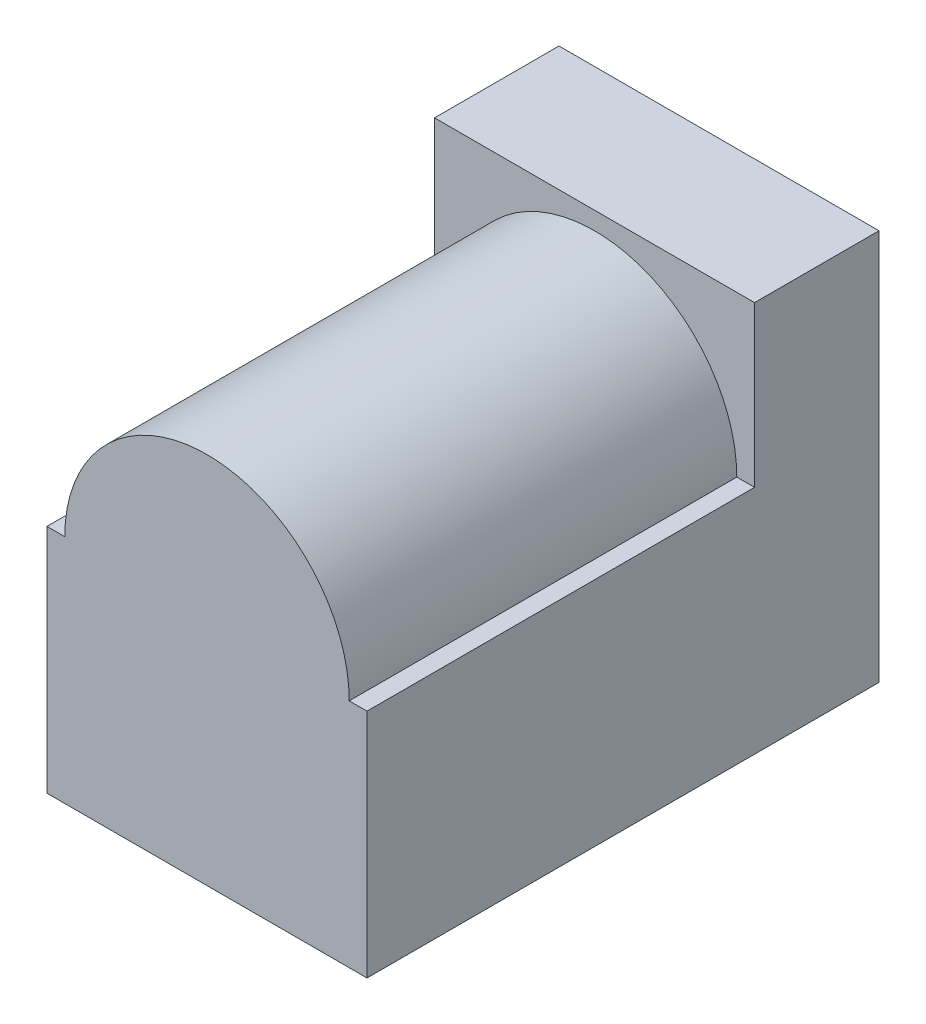
ISO-10303-21;
HEADER;
FILE_DESCRIPTION(('STEP AP214'),'2;1');
FILE_NAME('part.step','',(''),(''),'','','');
FILE_SCHEMA(('AUTOMOTIVE_DESIGN { 1 0 10303 214 1 1 1 1 }'));
ENDSEC;
DATA;
#1=APPLICATION_CONTEXT('core data for automotive mechanical design processes');
#2=APPLICATION_PROTOCOL_DEFINITION('international standard','automotive_design',2000,#1);
#3=PRODUCT_CONTEXT('',#1,'mechanical');
#4=PRODUCT('Part','Part','',(#3));
#5=PRODUCT_RELATED_PRODUCT_CATEGORY('part','',(#4));
#6=PRODUCT_DEFINITION_FORMATION('','',#4);
#7=PRODUCT_DEFINITION_CONTEXT('part definition',#1,'design');
#8=PRODUCT_DEFINITION('design','',#6,#7);
#9=PRODUCT_DEFINITION_SHAPE('','',#8);
#10=(LENGTH_UNIT() NAMED_UNIT(*) SI_UNIT(.MILLI.,.METRE.));
#11=(NAMED_UNIT(*) PLANE_ANGLE_UNIT() SI_UNIT($,.RADIAN.));
#12=(NAMED_UNIT(*) SI_UNIT($,.STERADIAN.) SOLID_ANGLE_UNIT());
#13=UNCERTAINTY_MEASURE_WITH_UNIT(LENGTH_MEASURE(1.E-05),#10,'distance_accuracy_value','');
#14=(GEOMETRIC_REPRESENTATION_CONTEXT(3) GLOBAL_UNCERTAINTY_ASSIGNED_CONTEXT((#13)) GLOBAL_UNIT_ASSIGNED_CONTEXT((#10,
#11,#12)) REPRESENTATION_CONTEXT('',''));
#15=CARTESIAN_POINT('',(0.,0.,0.));
#16=DIRECTION('',(0.,0.,1.));
#17=DIRECTION('',(1.,0.,0.));
#18=AXIS2_PLACEMENT_3D('',#15,#16,#17);
#19=CARTESIAN_POINT('',(0.,0.,3.5));
#20=DIRECTION('',(1.,0.,0.));
#21=DIRECTION('',(0.,0.,-1.));
#22=AXIS2_PLACEMENT_3D('',#19,#20,#21);
#23=PLANE('',#22);
#24=DIRECTION('',(0.,-1.,0.));
#25=VECTOR('',#24,1.);
#26=CARTESIAN_POINT('',(0.,0.,0.));
#27=LINE('',#26,#25);
#28=CARTESIAN_POINT('',(0.,11.,0.));
#29=VERTEX_POINT('',#28);
#30=CARTESIAN_POINT('',(0.,0.,0.));
#31=VERTEX_POINT('',#30);
#32=EDGE_CURVE('E96',#29,#31,#27,.T.);
#33=ORIENTED_EDGE('',*,*,#32,.T.);
#34=DIRECTION('',(0.,0.,-1.));
#35=VECTOR('',#34,1.);
#36=CARTESIAN_POINT('',(0.,0.,3.5));
#37=LINE('',#36,#35);
#38=CARTESIAN_POINT('',(0.,0.,14.4));
#39=VERTEX_POINT('',#38);
#40=EDGE_CURVE('E11',#39,#31,#37,.T.);
#41=ORIENTED_EDGE('',*,*,#40,.F.);
#42=DIRECTION('',(0.,1.,0.));
#43=VECTOR('',#42,1.);
#44=CARTESIAN_POINT('',(0.,6.5,14.4));
#45=LINE('',#44,#43);
#46=CARTESIAN_POINT('',(0.,6.5,14.4));
#47=VERTEX_POINT('',#46);
#48=EDGE_CURVE('E139',#39,#47,#45,.T.);
#49=ORIENTED_EDGE('',*,*,#48,.T.);
#50=DIRECTION('',(0.,0.,-1.));
#51=VECTOR('',#50,1.);
#52=CARTESIAN_POINT('',(0.,6.5,14.4));
#53=LINE('',#52,#51);
#54=CARTESIAN_POINT('',(0.,6.5,3.5));
#55=VERTEX_POINT('',#54);
#56=EDGE_CURVE('E154',#47,#55,#53,.T.);
#57=ORIENTED_EDGE('',*,*,#56,.T.);
#58=DIRECTION('',(0.,-1.,0.));
#59=VECTOR('',#58,1.);
#60=CARTESIAN_POINT('',(0.,0.,3.5));
#61=LINE('',#60,#59);
#62=CARTESIAN_POINT('',(0.,11.,3.5));
#63=VERTEX_POINT('',#62);
#64=EDGE_CURVE('E91',#63,#55,#61,.T.);
#65=ORIENTED_EDGE('',*,*,#64,.F.);
#66=DIRECTION('',(0.,0.,-1.));
#67=VECTOR('',#66,1.);
#68=CARTESIAN_POINT('',(0.,11.,3.5));
#69=LINE('',#68,#67);
#70=EDGE_CURVE('E84',#63,#29,#69,.T.);
#71=ORIENTED_EDGE('',*,*,#70,.T.);
#72=EDGE_LOOP('',(#33,#41,#49,#57,#65,#71));
#73=FACE_BOUND('',#72,.T.);
#74=ADVANCED_FACE('F39',(#73),#23,.F.);
#75=CARTESIAN_POINT('',(0.,0.,3.5));
#76=DIRECTION('',(0.,1.,0.));
#77=DIRECTION('',(0.,0.,1.));
#78=AXIS2_PLACEMENT_3D('',#75,#76,#77);
#79=PLANE('',#78);
#80=DIRECTION('',(1.,0.,0.));
#81=VECTOR('',#80,1.);
#82=CARTESIAN_POINT('',(0.,0.,0.));
#83=LINE('',#82,#81);
#84=CARTESIAN_POINT('',(9.,0.,0.));
#85=VERTEX_POINT('',#84);
#86=EDGE_CURVE('E101',#31,#85,#83,.T.);
#87=ORIENTED_EDGE('',*,*,#86,.T.);
#88=DIRECTION('',(0.,0.,-1.));
#89=VECTOR('',#88,1.);
#90=CARTESIAN_POINT('',(9.,0.,3.5));
#91=LINE('',#90,#89);
#92=CARTESIAN_POINT('',(9.,0.,14.4));
#93=VERTEX_POINT('',#92);
#94=EDGE_CURVE('E46',#93,#85,#91,.T.);
#95=ORIENTED_EDGE('',*,*,#94,.F.);
#96=DIRECTION('',(-1.,0.,0.));
#97=VECTOR('',#96,1.);
#98=CARTESIAN_POINT('',(0.,0.,14.4));
#99=LINE('',#98,#97);
#100=EDGE_CURVE('E129',#93,#39,#99,.T.);
#101=ORIENTED_EDGE('',*,*,#100,.T.);
#102=ORIENTED_EDGE('',*,*,#40,.T.);
#103=EDGE_LOOP('',(#87,#95,#101,#102));
#104=FACE_BOUND('',#103,.T.);
#105=ADVANCED_FACE('F127',(#104),#79,.F.);
#106=CARTESIAN_POINT('',(9.,0.,3.5));
#107=DIRECTION('',(-1.,0.,0.));
#108=DIRECTION('',(0.,-1.,0.));
#109=AXIS2_PLACEMENT_3D('',#106,#107,#108);
#110=PLANE('',#109);
#111=DIRECTION('',(0.,1.,0.));
#112=VECTOR('',#111,1.);
#113=CARTESIAN_POINT('',(9.,0.,3.5));
#114=LINE('',#113,#112);
#115=CARTESIAN_POINT('',(9.,6.5,3.5));
#116=VERTEX_POINT('',#115);
#117=CARTESIAN_POINT('',(9.,11.,3.5));
#118=VERTEX_POINT('',#117);
#119=EDGE_CURVE('E162',#116,#118,#114,.T.);
#120=ORIENTED_EDGE('',*,*,#119,.F.);
#121=DIRECTION('',(0.,0.,-1.));
#122=VECTOR('',#121,1.);
#123=CARTESIAN_POINT('',(9.,6.5,14.4));
#124=LINE('',#123,#122);
#125=CARTESIAN_POINT('',(9.,6.5,14.4));
#126=VERTEX_POINT('',#125);
#127=EDGE_CURVE('E53',#126,#116,#124,.T.);
#128=ORIENTED_EDGE('',*,*,#127,.F.);
#129=DIRECTION('',(0.,-1.,0.));
#130=VECTOR('',#129,1.);
#131=CARTESIAN_POINT('',(9.,0.,14.4));
#132=LINE('',#131,#130);
#133=EDGE_CURVE('E123',#126,#93,#132,.T.);
#134=ORIENTED_EDGE('',*,*,#133,.T.);
#135=ORIENTED_EDGE('',*,*,#94,.T.);
#136=DIRECTION('',(0.,1.,0.));
#137=VECTOR('',#136,1.);
#138=CARTESIAN_POINT('',(9.,0.,0.));
#139=LINE('',#138,#137);
#140=CARTESIAN_POINT('',(9.,11.,0.));
#141=VERTEX_POINT('',#140);
#142=EDGE_CURVE('E92',#85,#141,#139,.T.);
#143=ORIENTED_EDGE('',*,*,#142,.T.);
#144=DIRECTION('',(0.,0.,-1.));
#145=VECTOR('',#144,1.);
#146=CARTESIAN_POINT('',(9.,11.,3.5));
#147=LINE('',#146,#145);
#148=EDGE_CURVE('E87',#118,#141,#147,.T.);
#149=ORIENTED_EDGE('',*,*,#148,.F.);
#150=EDGE_LOOP('',(#120,#128,#134,#135,#143,#149));
#151=FACE_BOUND('',#150,.T.);
#152=ADVANCED_FACE('F120',(#151),#110,.F.);
#153=CARTESIAN_POINT('',(0.,11.,3.5));
#154=DIRECTION('',(0.,-1.,0.));
#155=DIRECTION('',(0.,0.,-1.));
#156=AXIS2_PLACEMENT_3D('',#153,#154,#155);
#157=PLANE('',#156);
#158=DIRECTION('',(-1.,0.,0.));
#159=VECTOR('',#158,1.);
#160=CARTESIAN_POINT('',(0.,11.,0.));
#161=LINE('',#160,#159);
#162=EDGE_CURVE('E81',#141,#29,#161,.T.);
#163=ORIENTED_EDGE('',*,*,#162,.T.);
#164=ORIENTED_EDGE('',*,*,#70,.F.);
#165=DIRECTION('',(-1.,0.,0.));
#166=VECTOR('',#165,1.);
#167=CARTESIAN_POINT('',(0.,11.,3.5));
#168=LINE('',#167,#166);
#169=EDGE_CURVE('E62',#118,#63,#168,.T.);
#170=ORIENTED_EDGE('',*,*,#169,.F.);
#171=ORIENTED_EDGE('',*,*,#148,.T.);
#172=EDGE_LOOP('',(#163,#164,#170,#171));
#173=FACE_BOUND('',#172,.T.);
#174=ADVANCED_FACE('F83',(#173),#157,.F.);
#175=CARTESIAN_POINT('',(0.,0.,3.5));
#176=DIRECTION('',(0.,0.,-1.));
#177=DIRECTION('',(-1.,0.,0.));
#178=AXIS2_PLACEMENT_3D('',#175,#176,#177);
#179=PLANE('',#178);
#180=ORIENTED_EDGE('',*,*,#64,.T.);
#181=DIRECTION('',(1.,0.,0.));
#182=VECTOR('',#181,1.);
#183=CARTESIAN_POINT('',(0.,6.5,3.5));
#184=LINE('',#183,#182);
#185=CARTESIAN_POINT('',(0.5,6.5,3.5));
#186=VERTEX_POINT('',#185);
#187=EDGE_CURVE('E109',#55,#186,#184,.T.);
#188=ORIENTED_EDGE('',*,*,#187,.T.);
#189=CARTESIAN_POINT('',(4.5,6.5,3.5));
#190=DIRECTION('',(0.,0.,-1.));
#191=DIRECTION('',(-1.,0.,0.));
#192=AXIS2_PLACEMENT_3D('',#189,#190,#191);
#193=CIRCLE('',#192,4.);
#194=CARTESIAN_POINT('',(8.5,6.5,3.5));
#195=VERTEX_POINT('',#194);
#196=EDGE_CURVE('E103',#186,#195,#193,.T.);
#197=ORIENTED_EDGE('',*,*,#196,.T.);
#198=DIRECTION('',(1.,0.,0.));
#199=VECTOR('',#198,1.);
#200=CARTESIAN_POINT('',(0.,6.5,3.5));
#201=LINE('',#200,#199);
#202=EDGE_CURVE('E153',#195,#116,#201,.T.);
#203=ORIENTED_EDGE('',*,*,#202,.T.);
#204=ORIENTED_EDGE('',*,*,#119,.T.);
#205=ORIENTED_EDGE('',*,*,#169,.T.);
#206=EDGE_LOOP('',(#180,#188,#197,#203,#204,#205));
#207=FACE_BOUND('',#206,.T.);
#208=ADVANCED_FACE('F163',(#207),#179,.F.);
#209=CARTESIAN_POINT('',(0.,0.,0.));
#210=DIRECTION('',(0.,0.,-1.));
#211=DIRECTION('',(-1.,0.,0.));
#212=AXIS2_PLACEMENT_3D('',#209,#210,#211);
#213=PLANE('',#212);
#214=CARTESIAN_POINT('',(4.5,6.5,0.));
#215=DIRECTION('',(0.,0.,-1.));
#216=DIRECTION('',(-1.,0.,0.));
#217=AXIS2_PLACEMENT_3D('',#214,#215,#216);
#218=CIRCLE('',#217,3.25);
#219=CARTESIAN_POINT('',(1.25,6.5,0.));
#220=VERTEX_POINT('',#219);
#221=EDGE_CURVE('E190',#220,#220,#218,.T.);
#222=ORIENTED_EDGE('',*,*,#221,.F.);
#223=EDGE_LOOP('',(#222));
#224=FACE_BOUND('',#223,.T.);
#225=ORIENTED_EDGE('',*,*,#86,.F.);
#226=ORIENTED_EDGE('',*,*,#32,.F.);
#227=ORIENTED_EDGE('',*,*,#162,.F.);
#228=ORIENTED_EDGE('',*,*,#142,.F.);
#229=EDGE_LOOP('',(#225,#226,#227,#228));
#230=FACE_BOUND('',#229,.T.);
#231=ADVANCED_FACE('F100',(#224,#230),#213,.T.);
#232=CARTESIAN_POINT('',(4.5,6.5,14.4));
#233=DIRECTION('',(0.,0.,-1.));
#234=DIRECTION('',(-1.,0.,0.));
#235=AXIS2_PLACEMENT_3D('',#232,#233,#234);
#236=CYLINDRICAL_SURFACE('',#235,4.);
#237=ORIENTED_EDGE('',*,*,#196,.F.);
#238=DIRECTION('',(0.,0.,-1.));
#239=VECTOR('',#238,1.);
#240=CARTESIAN_POINT('',(0.5,6.5,14.4));
#241=LINE('',#240,#239);
#242=CARTESIAN_POINT('',(0.5,6.5,14.4));
#243=VERTEX_POINT('',#242);
#244=EDGE_CURVE('E150',#243,#186,#241,.T.);
#245=ORIENTED_EDGE('',*,*,#244,.F.);
#246=CARTESIAN_POINT('',(4.5,6.5,14.4));
#247=DIRECTION('',(0.,0.,-1.));
#248=DIRECTION('',(-1.,0.,0.));
#249=AXIS2_PLACEMENT_3D('',#246,#247,#248);
#250=CIRCLE('',#249,4.);
#251=CARTESIAN_POINT('',(8.5,6.5,14.4));
#252=VERTEX_POINT('',#251);
#253=EDGE_CURVE('E186',#243,#252,#250,.T.);
#254=ORIENTED_EDGE('',*,*,#253,.T.);
#255=DIRECTION('',(0.,0.,-1.));
#256=VECTOR('',#255,1.);
#257=CARTESIAN_POINT('',(8.5,6.5,14.4));
#258=LINE('',#257,#256);
#259=EDGE_CURVE('E149',#252,#195,#258,.T.);
#260=ORIENTED_EDGE('',*,*,#259,.T.);
#261=EDGE_LOOP('',(#237,#245,#254,#260));
#262=FACE_BOUND('',#261,.T.);
#263=ADVANCED_FACE('F182',(#262),#236,.T.);
#264=CARTESIAN_POINT('',(0.5,6.5,14.4));
#265=DIRECTION('',(0.,1.,0.));
#266=DIRECTION('',(0.,0.,1.));
#267=AXIS2_PLACEMENT_3D('',#264,#265,#266);
#268=PLANE('',#267);
#269=ORIENTED_EDGE('',*,*,#187,.F.);
#270=ORIENTED_EDGE('',*,*,#56,.F.);
#271=DIRECTION('',(1.,0.,0.));
#272=VECTOR('',#271,1.);
#273=CARTESIAN_POINT('',(0.5,6.5,14.4));
#274=LINE('',#273,#272);
#275=EDGE_CURVE('E141',#47,#243,#274,.T.);
#276=ORIENTED_EDGE('',*,*,#275,.T.);
#277=ORIENTED_EDGE('',*,*,#244,.T.);
#278=EDGE_LOOP('',(#269,#270,#276,#277));
#279=FACE_BOUND('',#278,.T.);
#280=ADVANCED_FACE('F185',(#279),#268,.T.);
#281=CARTESIAN_POINT('',(9.,6.5,14.4));
#282=DIRECTION('',(0.,1.,0.));
#283=DIRECTION('',(0.,0.,1.));
#284=AXIS2_PLACEMENT_3D('',#281,#282,#283);
#285=PLANE('',#284);
#286=ORIENTED_EDGE('',*,*,#202,.F.);
#287=ORIENTED_EDGE('',*,*,#259,.F.);
#288=DIRECTION('',(1.,0.,0.));
#289=VECTOR('',#288,1.);
#290=CARTESIAN_POINT('',(9.,6.5,14.4));
#291=LINE('',#290,#289);
#292=EDGE_CURVE('E143',#252,#126,#291,.T.);
#293=ORIENTED_EDGE('',*,*,#292,.T.);
#294=ORIENTED_EDGE('',*,*,#127,.T.);
#295=EDGE_LOOP('',(#286,#287,#293,#294));
#296=FACE_BOUND('',#295,.T.);
#297=ADVANCED_FACE('F266',(#296),#285,.T.);
#298=CARTESIAN_POINT('',(4.5,6.5,14.4));
#299=DIRECTION('',(0.,0.,-1.));
#300=DIRECTION('',(-1.,0.,0.));
#301=AXIS2_PLACEMENT_3D('',#298,#299,#300);
#302=PLANE('',#301);
#303=ORIENTED_EDGE('',*,*,#253,.F.);
#304=ORIENTED_EDGE('',*,*,#275,.F.);
#305=ORIENTED_EDGE('',*,*,#48,.F.);
#306=ORIENTED_EDGE('',*,*,#100,.F.);
#307=ORIENTED_EDGE('',*,*,#133,.F.);
#308=ORIENTED_EDGE('',*,*,#292,.F.);
#309=EDGE_LOOP('',(#303,#304,#305,#306,#307,#308));
#310=FACE_BOUND('',#309,.T.);
#311=ADVANCED_FACE('F135',(#310),#302,.F.);
#312=CARTESIAN_POINT('',(4.5,6.5,10.));
#313=DIRECTION('',(0.,0.,-1.));
#314=DIRECTION('',(-1.,0.,0.));
#315=AXIS2_PLACEMENT_3D('',#312,#313,#314);
#316=CYLINDRICAL_SURFACE('',#315,3.25);
#317=CARTESIAN_POINT('',(4.5,6.5,10.));
#318=DIRECTION('',(0.,0.,-1.));
#319=DIRECTION('',(-1.,0.,0.));
#320=AXIS2_PLACEMENT_3D('',#317,#318,#319);
#321=CIRCLE('',#320,3.25);
#322=CARTESIAN_POINT('',(1.25,6.5,10.));
#323=VERTEX_POINT('',#322);
#324=EDGE_CURVE('E187',#323,#323,#321,.T.);
#325=ORIENTED_EDGE('',*,*,#324,.F.);
#326=EDGE_LOOP('',(#325));
#327=FACE_BOUND('',#326,.T.);
#328=ORIENTED_EDGE('',*,*,#221,.T.);
#329=EDGE_LOOP('',(#328));
#330=FACE_BOUND('',#329,.T.);
#331=ADVANCED_FACE('F208',(#327,#330),#316,.F.);
#332=CARTESIAN_POINT('',(4.5,6.5,10.));
#333=DIRECTION('',(0.,0.,-1.));
#334=DIRECTION('',(-1.,0.,0.));
#335=AXIS2_PLACEMENT_3D('',#332,#333,#334);
#336=PLANE('',#335);
#337=CARTESIAN_POINT('',(4.5,6.5,10.));
#338=DIRECTION('',(0.,0.,-1.));
#339=DIRECTION('',(-1.,0.,0.));
#340=AXIS2_PLACEMENT_3D('',#337,#338,#339);
#341=CIRCLE('',#340,1.);
#342=CARTESIAN_POINT('',(3.5,6.5,10.));
#343=VERTEX_POINT('',#342);
#344=EDGE_CURVE('E194',#343,#343,#341,.T.);
#345=ORIENTED_EDGE('',*,*,#344,.F.);
#346=EDGE_LOOP('',(#345));
#347=FACE_BOUND('',#346,.T.);
#348=ORIENTED_EDGE('',*,*,#324,.T.);
#349=EDGE_LOOP('',(#348));
#350=FACE_BOUND('',#349,.T.);
#351=ADVANCED_FACE('F205',(#347,#350),#336,.T.);
#352=CARTESIAN_POINT('',(4.5,6.5,10.));
#353=DIRECTION('',(0.,0.,-1.));
#354=DIRECTION('',(-1.,0.,0.));
#355=AXIS2_PLACEMENT_3D('',#352,#353,#354);
#356=CYLINDRICAL_SURFACE('',#355,1.);
#357=ORIENTED_EDGE('',*,*,#344,.T.);
#358=EDGE_LOOP('',(#357));
#359=FACE_BOUND('',#358,.T.);
#360=CARTESIAN_POINT('',(4.5,6.5,0.));
#361=DIRECTION('',(0.,0.,-1.));
#362=DIRECTION('',(-1.,0.,0.));
#363=AXIS2_PLACEMENT_3D('',#360,#361,#362);
#364=CIRCLE('',#363,1.);
#365=CARTESIAN_POINT('',(3.5,6.5,0.));
#366=VERTEX_POINT('',#365);
#367=EDGE_CURVE('E196',#366,#366,#364,.T.);
#368=ORIENTED_EDGE('',*,*,#367,.F.);
#369=EDGE_LOOP('',(#368));
#370=FACE_BOUND('',#369,.T.);
#371=ADVANCED_FACE('F202',(#359,#370),#356,.T.);
#372=ORIENTED_EDGE('',*,*,#367,.T.);
#373=EDGE_LOOP('',(#372));
#374=FACE_BOUND('',#373,.T.);
#375=ADVANCED_FACE('F219',(#374),#213,.T.);
#376=CLOSED_SHELL('',(#74,#105,#152,#174,#208,#231,#263,#280,#297,#311,#331,#351,#371,#375));
#377=MANIFOLD_SOLID_BREP('B2',#376);
#378=ADVANCED_BREP_SHAPE_REPRESENTATION('',(#18,#377),#14);
#379=SHAPE_DEFINITION_REPRESENTATION(#9,#378);
ENDSEC;
END-ISO-10303-21;
